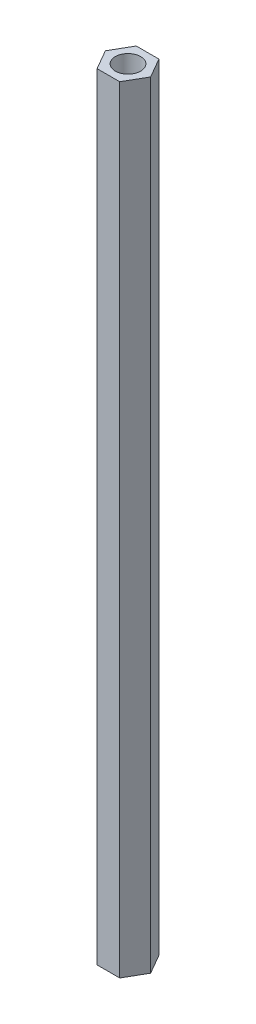
ISO-10303-21;
HEADER;
FILE_DESCRIPTION(('STEP AP214'),'2;1');
FILE_NAME('part.step','',(''),(''),'','','');
FILE_SCHEMA(('AUTOMOTIVE_DESIGN { 1 0 10303 214 1 1 1 1 }'));
ENDSEC;
DATA;
#1=APPLICATION_CONTEXT('core data for automotive mechanical design processes');
#2=APPLICATION_PROTOCOL_DEFINITION('international standard','automotive_design',2000,#1);
#3=PRODUCT_CONTEXT('',#1,'mechanical');
#4=PRODUCT('Part','Part','',(#3));
#5=PRODUCT_RELATED_PRODUCT_CATEGORY('part','',(#4));
#6=PRODUCT_DEFINITION_FORMATION('','',#4);
#7=PRODUCT_DEFINITION_CONTEXT('part definition',#1,'design');
#8=PRODUCT_DEFINITION('design','',#6,#7);
#9=PRODUCT_DEFINITION_SHAPE('','',#8);
#10=(LENGTH_UNIT() NAMED_UNIT(*) SI_UNIT(.MILLI.,.METRE.));
#11=(NAMED_UNIT(*) PLANE_ANGLE_UNIT() SI_UNIT($,.RADIAN.));
#12=(NAMED_UNIT(*) SI_UNIT($,.STERADIAN.) SOLID_ANGLE_UNIT());
#13=UNCERTAINTY_MEASURE_WITH_UNIT(LENGTH_MEASURE(1.E-05),#10,'distance_accuracy_value','');
#14=(GEOMETRIC_REPRESENTATION_CONTEXT(3) GLOBAL_UNCERTAINTY_ASSIGNED_CONTEXT((#13)) GLOBAL_UNIT_ASSIGNED_CONTEXT((#10,
#11,#12)) REPRESENTATION_CONTEXT('',''));
#15=CARTESIAN_POINT('',(0.,0.,0.));
#16=DIRECTION('',(0.,0.,1.));
#17=DIRECTION('',(1.,0.,0.));
#18=AXIS2_PLACEMENT_3D('',#15,#16,#17);
#19=CARTESIAN_POINT('',(0.,92.,0.));
#20=DIRECTION('',(0.,-1.,0.));
#21=DIRECTION('',(0.,0.,-1.));
#22=AXIS2_PLACEMENT_3D('',#19,#20,#21);
#23=PLANE('',#22);
#24=DIRECTION('',(-0.5,0.,0.866025403784439));
#25=VECTOR('',#24,1.);
#26=CARTESIAN_POINT('',(-2.68275799921944,92.,-1.11130722679764E-13));
#27=LINE('',#26,#25);
#28=CARTESIAN_POINT('',(-1.34137899960966,92.,-2.32333657953018));
#29=VERTEX_POINT('',#28);
#30=CARTESIAN_POINT('',(-2.68275799921944,92.,-1.11130722679764E-13));
#31=VERTEX_POINT('',#30);
#32=EDGE_CURVE('E132',#29,#31,#27,.T.);
#33=ORIENTED_EDGE('',*,*,#32,.T.);
#34=DIRECTION('',(0.5,0.,0.866025403784438));
#35=VECTOR('',#34,1.);
#36=CARTESIAN_POINT('',(-1.34137899960965,92.,2.32333657952995));
#37=LINE('',#36,#35);
#38=CARTESIAN_POINT('',(-1.34137899960965,92.,2.32333657952995));
#39=VERTEX_POINT('',#38);
#40=EDGE_CURVE('E90',#31,#39,#37,.T.);
#41=ORIENTED_EDGE('',*,*,#40,.T.);
#42=DIRECTION('',(1.,0.,0.));
#43=VECTOR('',#42,1.);
#44=CARTESIAN_POINT('',(1.34137899960992,92.,2.32333657952995));
#45=LINE('',#44,#43);
#46=CARTESIAN_POINT('',(1.34137899960992,92.,2.32333657952995));
#47=VERTEX_POINT('',#46);
#48=EDGE_CURVE('E103',#39,#47,#45,.T.);
#49=ORIENTED_EDGE('',*,*,#48,.T.);
#50=DIRECTION('',(0.5,0.,-0.866025403784439));
#51=VECTOR('',#50,1.);
#52=CARTESIAN_POINT('',(2.68275799921971,92.,-1.13299127024735E-13));
#53=LINE('',#52,#51);
#54=CARTESIAN_POINT('',(2.68275799921971,92.,-1.13299127024735E-13));
#55=VERTEX_POINT('',#54);
#56=EDGE_CURVE('E97',#47,#55,#53,.T.);
#57=ORIENTED_EDGE('',*,*,#56,.T.);
#58=DIRECTION('',(-0.5,0.,-0.866025403784439));
#59=VECTOR('',#58,1.);
#60=CARTESIAN_POINT('',(1.34137899960992,92.,-2.32333657953018));
#61=LINE('',#60,#59);
#62=CARTESIAN_POINT('',(1.34137899960992,92.,-2.32333657953018));
#63=VERTEX_POINT('',#62);
#64=EDGE_CURVE('E101',#55,#63,#61,.T.);
#65=ORIENTED_EDGE('',*,*,#64,.T.);
#66=DIRECTION('',(-1.,0.,0.));
#67=VECTOR('',#66,1.);
#68=CARTESIAN_POINT('',(-1.34137899960966,92.,-2.32333657953018));
#69=LINE('',#68,#67);
#70=EDGE_CURVE('E53',#63,#29,#69,.T.);
#71=ORIENTED_EDGE('',*,*,#70,.T.);
#72=EDGE_LOOP('',(#33,#41,#49,#57,#65,#71));
#73=FACE_BOUND('',#72,.T.);
#74=CARTESIAN_POINT('',(0.,92.,0.));
#75=DIRECTION('',(0.,1.,0.));
#76=DIRECTION('',(0.,0.,1.));
#77=AXIS2_PLACEMENT_3D('',#74,#75,#76);
#78=CIRCLE('',#77,1.5);
#79=CARTESIAN_POINT('',(0.,92.,1.5));
#80=VERTEX_POINT('',#79);
#81=EDGE_CURVE('E125',#80,#80,#78,.T.);
#82=ORIENTED_EDGE('',*,*,#81,.F.);
#83=EDGE_LOOP('',(#82));
#84=FACE_BOUND('',#83,.T.);
#85=ADVANCED_FACE('F36',(#73,#84),#23,.F.);
#86=CARTESIAN_POINT('',(0.,0.,0.));
#87=DIRECTION('',(0.,-1.,0.));
#88=DIRECTION('',(0.,0.,-1.));
#89=AXIS2_PLACEMENT_3D('',#86,#87,#88);
#90=PLANE('',#89);
#91=DIRECTION('',(-0.5,0.,0.866025403784439));
#92=VECTOR('',#91,1.);
#93=CARTESIAN_POINT('',(-2.68275799921944,0.,-1.11130722679764E-13));
#94=LINE('',#93,#92);
#95=CARTESIAN_POINT('',(-1.34137899960966,0.,-2.32333657953018));
#96=VERTEX_POINT('',#95);
#97=CARTESIAN_POINT('',(-2.68275799921944,0.,-1.11130722679764E-13));
#98=VERTEX_POINT('',#97);
#99=EDGE_CURVE('E121',#96,#98,#94,.T.);
#100=ORIENTED_EDGE('',*,*,#99,.F.);
#101=DIRECTION('',(-1.,0.,0.));
#102=VECTOR('',#101,1.);
#103=CARTESIAN_POINT('',(-1.34137899960966,0.,-2.32333657953018));
#104=LINE('',#103,#102);
#105=CARTESIAN_POINT('',(1.34137899960992,0.,-2.32333657953018));
#106=VERTEX_POINT('',#105);
#107=EDGE_CURVE('E82',#106,#96,#104,.T.);
#108=ORIENTED_EDGE('',*,*,#107,.F.);
#109=DIRECTION('',(-0.5,0.,-0.866025403784439));
#110=VECTOR('',#109,1.);
#111=CARTESIAN_POINT('',(1.34137899960992,0.,-2.32333657953018));
#112=LINE('',#111,#110);
#113=CARTESIAN_POINT('',(2.68275799921971,0.,-1.13299127024735E-13));
#114=VERTEX_POINT('',#113);
#115=EDGE_CURVE('E76',#114,#106,#112,.T.);
#116=ORIENTED_EDGE('',*,*,#115,.F.);
#117=DIRECTION('',(0.5,0.,-0.866025403784439));
#118=VECTOR('',#117,1.);
#119=CARTESIAN_POINT('',(2.68275799921971,0.,-1.13299127024735E-13));
#120=LINE('',#119,#118);
#121=CARTESIAN_POINT('',(1.34137899960992,0.,2.32333657952995));
#122=VERTEX_POINT('',#121);
#123=EDGE_CURVE('E111',#122,#114,#120,.T.);
#124=ORIENTED_EDGE('',*,*,#123,.F.);
#125=DIRECTION('',(1.,0.,0.));
#126=VECTOR('',#125,1.);
#127=CARTESIAN_POINT('',(1.34137899960992,0.,2.32333657952995));
#128=LINE('',#127,#126);
#129=CARTESIAN_POINT('',(-1.34137899960965,0.,2.32333657952995));
#130=VERTEX_POINT('',#129);
#131=EDGE_CURVE('E127',#130,#122,#128,.T.);
#132=ORIENTED_EDGE('',*,*,#131,.F.);
#133=DIRECTION('',(0.5,0.,0.866025403784438));
#134=VECTOR('',#133,1.);
#135=CARTESIAN_POINT('',(-1.34137899960965,0.,2.32333657952995));
#136=LINE('',#135,#134);
#137=EDGE_CURVE('E124',#98,#130,#136,.T.);
#138=ORIENTED_EDGE('',*,*,#137,.F.);
#139=EDGE_LOOP('',(#100,#108,#116,#124,#132,#138));
#140=FACE_BOUND('',#139,.T.);
#141=CARTESIAN_POINT('',(0.,0.,0.));
#142=DIRECTION('',(0.,1.,0.));
#143=DIRECTION('',(0.,0.,1.));
#144=AXIS2_PLACEMENT_3D('',#141,#142,#143);
#145=CIRCLE('',#144,1.5);
#146=CARTESIAN_POINT('',(0.,0.,1.5));
#147=VERTEX_POINT('',#146);
#148=EDGE_CURVE('E225',#147,#147,#145,.T.);
#149=ORIENTED_EDGE('',*,*,#148,.T.);
#150=EDGE_LOOP('',(#149));
#151=FACE_BOUND('',#150,.T.);
#152=ADVANCED_FACE('F141',(#140,#151),#90,.T.);
#153=CARTESIAN_POINT('',(-2.68275799921944,92.,-1.11130722679764E-13));
#154=DIRECTION('',(0.866025403784439,0.,0.5));
#155=DIRECTION('',(0.5,0.,-0.866025403784439));
#156=AXIS2_PLACEMENT_3D('',#153,#154,#155);
#157=PLANE('',#156);
#158=ORIENTED_EDGE('',*,*,#99,.T.);
#159=DIRECTION('',(0.,-1.,0.));
#160=VECTOR('',#159,1.);
#161=CARTESIAN_POINT('',(-2.68275799921944,92.,-1.11130722679764E-13));
#162=LINE('',#161,#160);
#163=EDGE_CURVE('E11',#31,#98,#162,.T.);
#164=ORIENTED_EDGE('',*,*,#163,.F.);
#165=ORIENTED_EDGE('',*,*,#32,.F.);
#166=DIRECTION('',(0.,-1.,0.));
#167=VECTOR('',#166,1.);
#168=CARTESIAN_POINT('',(-1.34137899960966,92.,-2.32333657953018));
#169=LINE('',#168,#167);
#170=EDGE_CURVE('E117',#29,#96,#169,.T.);
#171=ORIENTED_EDGE('',*,*,#170,.T.);
#172=EDGE_LOOP('',(#158,#164,#165,#171));
#173=FACE_BOUND('',#172,.T.);
#174=ADVANCED_FACE('F38',(#173),#157,.F.);
#175=CARTESIAN_POINT('',(-1.34137899960965,92.,2.32333657952995));
#176=DIRECTION('',(0.866025403784438,0.,-0.5));
#177=DIRECTION('',(-0.500000000000001,0.,-0.866025403784438));
#178=AXIS2_PLACEMENT_3D('',#175,#176,#177);
#179=PLANE('',#178);
#180=ORIENTED_EDGE('',*,*,#137,.T.);
#181=DIRECTION('',(0.,-1.,0.));
#182=VECTOR('',#181,1.);
#183=CARTESIAN_POINT('',(-1.34137899960965,92.,2.32333657952995));
#184=LINE('',#183,#182);
#185=EDGE_CURVE('E45',#39,#130,#184,.T.);
#186=ORIENTED_EDGE('',*,*,#185,.F.);
#187=ORIENTED_EDGE('',*,*,#40,.F.);
#188=ORIENTED_EDGE('',*,*,#163,.T.);
#189=EDGE_LOOP('',(#180,#186,#187,#188));
#190=FACE_BOUND('',#189,.T.);
#191=ADVANCED_FACE('F166',(#190),#179,.F.);
#192=CARTESIAN_POINT('',(1.34137899960992,92.,2.32333657952995));
#193=DIRECTION('',(0.,0.,-1.));
#194=DIRECTION('',(-1.,0.,0.));
#195=AXIS2_PLACEMENT_3D('',#192,#193,#194);
#196=PLANE('',#195);
#197=ORIENTED_EDGE('',*,*,#131,.T.);
#198=DIRECTION('',(0.,-1.,0.));
#199=VECTOR('',#198,1.);
#200=CARTESIAN_POINT('',(1.34137899960992,92.,2.32333657952995));
#201=LINE('',#200,#199);
#202=EDGE_CURVE('E112',#47,#122,#201,.T.);
#203=ORIENTED_EDGE('',*,*,#202,.F.);
#204=ORIENTED_EDGE('',*,*,#48,.F.);
#205=ORIENTED_EDGE('',*,*,#185,.T.);
#206=EDGE_LOOP('',(#197,#203,#204,#205));
#207=FACE_BOUND('',#206,.T.);
#208=ADVANCED_FACE('F138',(#207),#196,.F.);
#209=CARTESIAN_POINT('',(2.68275799921971,92.,-1.13299127024735E-13));
#210=DIRECTION('',(-0.866025403784439,0.,-0.5));
#211=DIRECTION('',(-0.5,0.,0.866025403784439));
#212=AXIS2_PLACEMENT_3D('',#209,#210,#211);
#213=PLANE('',#212);
#214=ORIENTED_EDGE('',*,*,#123,.T.);
#215=DIRECTION('',(0.,-1.,0.));
#216=VECTOR('',#215,1.);
#217=CARTESIAN_POINT('',(2.68275799921971,92.,-1.13299127024735E-13));
#218=LINE('',#217,#216);
#219=EDGE_CURVE('E108',#55,#114,#218,.T.);
#220=ORIENTED_EDGE('',*,*,#219,.F.);
#221=ORIENTED_EDGE('',*,*,#56,.F.);
#222=ORIENTED_EDGE('',*,*,#202,.T.);
#223=EDGE_LOOP('',(#214,#220,#221,#222));
#224=FACE_BOUND('',#223,.T.);
#225=ADVANCED_FACE('F109',(#224),#213,.F.);
#226=CARTESIAN_POINT('',(1.34137899960992,92.,-2.32333657953018));
#227=DIRECTION('',(-0.866025403784439,0.,0.5));
#228=DIRECTION('',(0.5,0.,0.866025403784439));
#229=AXIS2_PLACEMENT_3D('',#226,#227,#228);
#230=PLANE('',#229);
#231=ORIENTED_EDGE('',*,*,#115,.T.);
#232=DIRECTION('',(0.,-1.,0.));
#233=VECTOR('',#232,1.);
#234=CARTESIAN_POINT('',(1.34137899960992,92.,-2.32333657953018));
#235=LINE('',#234,#233);
#236=EDGE_CURVE('E113',#63,#106,#235,.T.);
#237=ORIENTED_EDGE('',*,*,#236,.F.);
#238=ORIENTED_EDGE('',*,*,#64,.F.);
#239=ORIENTED_EDGE('',*,*,#219,.T.);
#240=EDGE_LOOP('',(#231,#237,#238,#239));
#241=FACE_BOUND('',#240,.T.);
#242=ADVANCED_FACE('F115',(#241),#230,.F.);
#243=CARTESIAN_POINT('',(-1.34137899960966,92.,-2.32333657953018));
#244=DIRECTION('',(0.,0.,1.));
#245=DIRECTION('',(1.,0.,0.));
#246=AXIS2_PLACEMENT_3D('',#243,#244,#245);
#247=PLANE('',#246);
#248=ORIENTED_EDGE('',*,*,#107,.T.);
#249=ORIENTED_EDGE('',*,*,#170,.F.);
#250=ORIENTED_EDGE('',*,*,#70,.F.);
#251=ORIENTED_EDGE('',*,*,#236,.T.);
#252=EDGE_LOOP('',(#248,#249,#250,#251));
#253=FACE_BOUND('',#252,.T.);
#254=ADVANCED_FACE('F146',(#253),#247,.F.);
#255=CARTESIAN_POINT('',(0.,92.,0.));
#256=DIRECTION('',(0.,-1.,0.));
#257=DIRECTION('',(0.,0.,-1.));
#258=AXIS2_PLACEMENT_3D('',#255,#256,#257);
#259=CYLINDRICAL_SURFACE('',#258,1.5);
#260=ORIENTED_EDGE('',*,*,#81,.T.);
#261=EDGE_LOOP('',(#260));
#262=FACE_BOUND('',#261,.T.);
#263=ORIENTED_EDGE('',*,*,#148,.F.);
#264=EDGE_LOOP('',(#263));
#265=FACE_BOUND('',#264,.T.);
#266=ADVANCED_FACE('F148',(#262,#265),#259,.F.);
#267=CLOSED_SHELL('',(#85,#152,#174,#191,#208,#225,#242,#254,#266));
#268=MANIFOLD_SOLID_BREP('B2',#267);
#269=ADVANCED_BREP_SHAPE_REPRESENTATION('',(#18,#268),#14);
#270=SHAPE_DEFINITION_REPRESENTATION(#9,#269);
ENDSEC;
END-ISO-10303-21;
